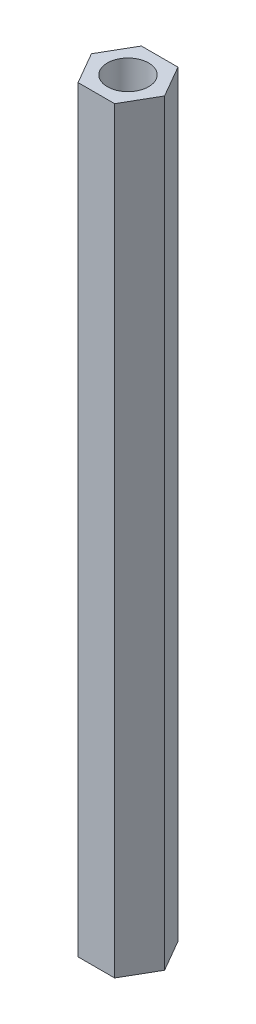
ISO-10303-21;
HEADER;
FILE_DESCRIPTION(('STEP AP214'),'2;1');
FILE_NAME('part.step','',(''),(''),'','','');
FILE_SCHEMA(('AUTOMOTIVE_DESIGN { 1 0 10303 214 1 1 1 1 }'));
ENDSEC;
DATA;
#1=APPLICATION_CONTEXT('core data for automotive mechanical design processes');
#2=APPLICATION_PROTOCOL_DEFINITION('international standard','automotive_design',2000,#1);
#3=PRODUCT_CONTEXT('',#1,'mechanical');
#4=PRODUCT('Part','Part','',(#3));
#5=PRODUCT_RELATED_PRODUCT_CATEGORY('part','',(#4));
#6=PRODUCT_DEFINITION_FORMATION('','',#4);
#7=PRODUCT_DEFINITION_CONTEXT('part definition',#1,'design');
#8=PRODUCT_DEFINITION('design','',#6,#7);
#9=PRODUCT_DEFINITION_SHAPE('','',#8);
#10=(LENGTH_UNIT() NAMED_UNIT(*) SI_UNIT(.MILLI.,.METRE.));
#11=(NAMED_UNIT(*) PLANE_ANGLE_UNIT() SI_UNIT($,.RADIAN.));
#12=(NAMED_UNIT(*) SI_UNIT($,.STERADIAN.) SOLID_ANGLE_UNIT());
#13=UNCERTAINTY_MEASURE_WITH_UNIT(LENGTH_MEASURE(1.E-05),#10,'distance_accuracy_value','');
#14=(GEOMETRIC_REPRESENTATION_CONTEXT(3) GLOBAL_UNCERTAINTY_ASSIGNED_CONTEXT((#13)) GLOBAL_UNIT_ASSIGNED_CONTEXT((#10,
#11,#12)) REPRESENTATION_CONTEXT('',''));
#15=CARTESIAN_POINT('',(0.,0.,0.));
#16=DIRECTION('',(0.,0.,1.));
#17=DIRECTION('',(1.,0.,0.));
#18=AXIS2_PLACEMENT_3D('',#15,#16,#17);
#19=CARTESIAN_POINT('',(-1.32790561913614,55.,2.3));
#20=DIRECTION('',(0.,0.,-1.));
#21=DIRECTION('',(-1.,0.,0.));
#22=AXIS2_PLACEMENT_3D('',#19,#20,#21);
#23=PLANE('',#22);
#24=DIRECTION('',(1.,0.,0.));
#25=VECTOR('',#24,1.);
#26=CARTESIAN_POINT('',(-1.32790561913614,0.,2.3));
#27=LINE('',#26,#25);
#28=CARTESIAN_POINT('',(-1.32790561913614,0.,2.3));
#29=VERTEX_POINT('',#28);
#30=CARTESIAN_POINT('',(1.32790561913614,0.,2.3));
#31=VERTEX_POINT('',#30);
#32=EDGE_CURVE('E128',#29,#31,#27,.T.);
#33=ORIENTED_EDGE('',*,*,#32,.T.);
#34=DIRECTION('',(0.,-1.,0.));
#35=VECTOR('',#34,1.);
#36=CARTESIAN_POINT('',(1.32790561913614,55.,2.3));
#37=LINE('',#36,#35);
#38=CARTESIAN_POINT('',(1.32790561913614,55.,2.3));
#39=VERTEX_POINT('',#38);
#40=EDGE_CURVE('E11',#39,#31,#37,.T.);
#41=ORIENTED_EDGE('',*,*,#40,.F.);
#42=DIRECTION('',(1.,0.,0.));
#43=VECTOR('',#42,1.);
#44=CARTESIAN_POINT('',(-1.32790561913614,55.,2.3));
#45=LINE('',#44,#43);
#46=CARTESIAN_POINT('',(-1.32790561913614,55.,2.3));
#47=VERTEX_POINT('',#46);
#48=EDGE_CURVE('E145',#47,#39,#45,.T.);
#49=ORIENTED_EDGE('',*,*,#48,.F.);
#50=DIRECTION('',(0.,-1.,0.));
#51=VECTOR('',#50,1.);
#52=CARTESIAN_POINT('',(-1.32790561913614,55.,2.3));
#53=LINE('',#52,#51);
#54=EDGE_CURVE('E124',#47,#29,#53,.T.);
#55=ORIENTED_EDGE('',*,*,#54,.T.);
#56=EDGE_LOOP('',(#33,#41,#49,#55));
#57=FACE_BOUND('',#56,.T.);
#58=ADVANCED_FACE('F39',(#57),#23,.F.);
#59=CARTESIAN_POINT('',(1.32790561913614,55.,2.3));
#60=DIRECTION('',(-0.866025403784439,0.,-0.5));
#61=DIRECTION('',(-0.5,0.,0.866025403784439));
#62=AXIS2_PLACEMENT_3D('',#59,#60,#61);
#63=PLANE('',#62);
#64=DIRECTION('',(0.5,0.,-0.866025403784438));
#65=VECTOR('',#64,1.);
#66=CARTESIAN_POINT('',(1.32790561913614,0.,2.3));
#67=LINE('',#66,#65);
#68=CARTESIAN_POINT('',(2.65581123827228,0.,0.));
#69=VERTEX_POINT('',#68);
#70=EDGE_CURVE('E132',#31,#69,#67,.T.);
#71=ORIENTED_EDGE('',*,*,#70,.T.);
#72=DIRECTION('',(0.,-1.,0.));
#73=VECTOR('',#72,1.);
#74=CARTESIAN_POINT('',(2.65581123827228,55.,0.));
#75=LINE('',#74,#73);
#76=CARTESIAN_POINT('',(2.65581123827228,55.,0.));
#77=VERTEX_POINT('',#76);
#78=EDGE_CURVE('E48',#77,#69,#75,.T.);
#79=ORIENTED_EDGE('',*,*,#78,.F.);
#80=DIRECTION('',(0.5,0.,-0.866025403784438));
#81=VECTOR('',#80,1.);
#82=CARTESIAN_POINT('',(1.32790561913614,55.,2.3));
#83=LINE('',#82,#81);
#84=EDGE_CURVE('E93',#39,#77,#83,.T.);
#85=ORIENTED_EDGE('',*,*,#84,.F.);
#86=ORIENTED_EDGE('',*,*,#40,.T.);
#87=EDGE_LOOP('',(#71,#79,#85,#86));
#88=FACE_BOUND('',#87,.T.);
#89=ADVANCED_FACE('F174',(#88),#63,.F.);
#90=CARTESIAN_POINT('',(2.65581123827228,55.,0.));
#91=DIRECTION('',(-0.866025403784439,0.,0.5));
#92=DIRECTION('',(0.5,0.,0.866025403784439));
#93=AXIS2_PLACEMENT_3D('',#90,#91,#92);
#94=PLANE('',#93);
#95=DIRECTION('',(-0.5,0.,-0.866025403784439));
#96=VECTOR('',#95,1.);
#97=CARTESIAN_POINT('',(2.65581123827228,0.,0.));
#98=LINE('',#97,#96);
#99=CARTESIAN_POINT('',(1.32790561913614,0.,-2.3));
#100=VERTEX_POINT('',#99);
#101=EDGE_CURVE('E136',#69,#100,#98,.T.);
#102=ORIENTED_EDGE('',*,*,#101,.T.);
#103=DIRECTION('',(0.,-1.,0.));
#104=VECTOR('',#103,1.);
#105=CARTESIAN_POINT('',(1.32790561913614,55.,-2.3));
#106=LINE('',#105,#104);
#107=CARTESIAN_POINT('',(1.32790561913614,55.,-2.3));
#108=VERTEX_POINT('',#107);
#109=EDGE_CURVE('E117',#108,#100,#106,.T.);
#110=ORIENTED_EDGE('',*,*,#109,.F.);
#111=DIRECTION('',(-0.5,0.,-0.866025403784439));
#112=VECTOR('',#111,1.);
#113=CARTESIAN_POINT('',(2.65581123827228,55.,0.));
#114=LINE('',#113,#112);
#115=EDGE_CURVE('E106',#77,#108,#114,.T.);
#116=ORIENTED_EDGE('',*,*,#115,.F.);
#117=ORIENTED_EDGE('',*,*,#78,.T.);
#118=EDGE_LOOP('',(#102,#110,#116,#117));
#119=FACE_BOUND('',#118,.T.);
#120=ADVANCED_FACE('F155',(#119),#94,.F.);
#121=CARTESIAN_POINT('',(1.32790561913614,55.,-2.3));
#122=DIRECTION('',(0.,0.,1.));
#123=DIRECTION('',(1.,0.,0.));
#124=AXIS2_PLACEMENT_3D('',#121,#122,#123);
#125=PLANE('',#124);
#126=DIRECTION('',(-1.,0.,0.));
#127=VECTOR('',#126,1.);
#128=CARTESIAN_POINT('',(1.32790561913614,0.,-2.3));
#129=LINE('',#128,#127);
#130=CARTESIAN_POINT('',(-1.32790561913614,0.,-2.3));
#131=VERTEX_POINT('',#130);
#132=EDGE_CURVE('E115',#100,#131,#129,.T.);
#133=ORIENTED_EDGE('',*,*,#132,.T.);
#134=DIRECTION('',(0.,-1.,0.));
#135=VECTOR('',#134,1.);
#136=CARTESIAN_POINT('',(-1.32790561913614,55.,-2.3));
#137=LINE('',#136,#135);
#138=CARTESIAN_POINT('',(-1.32790561913614,55.,-2.3));
#139=VERTEX_POINT('',#138);
#140=EDGE_CURVE('E112',#139,#131,#137,.T.);
#141=ORIENTED_EDGE('',*,*,#140,.F.);
#142=DIRECTION('',(-1.,0.,0.));
#143=VECTOR('',#142,1.);
#144=CARTESIAN_POINT('',(1.32790561913614,55.,-2.3));
#145=LINE('',#144,#143);
#146=EDGE_CURVE('E100',#108,#139,#145,.T.);
#147=ORIENTED_EDGE('',*,*,#146,.F.);
#148=ORIENTED_EDGE('',*,*,#109,.T.);
#149=EDGE_LOOP('',(#133,#141,#147,#148));
#150=FACE_BOUND('',#149,.T.);
#151=ADVANCED_FACE('F113',(#150),#125,.F.);
#152=CARTESIAN_POINT('',(-1.32790561913614,55.,-2.3));
#153=DIRECTION('',(0.866025403784439,0.,0.5));
#154=DIRECTION('',(0.5,0.,-0.866025403784439));
#155=AXIS2_PLACEMENT_3D('',#152,#153,#154);
#156=PLANE('',#155);
#157=DIRECTION('',(-0.5,0.,0.866025403784438));
#158=VECTOR('',#157,1.);
#159=CARTESIAN_POINT('',(-1.32790561913614,0.,-2.3));
#160=LINE('',#159,#158);
#161=CARTESIAN_POINT('',(-2.65581123827228,0.,0.));
#162=VERTEX_POINT('',#161);
#163=EDGE_CURVE('E79',#131,#162,#160,.T.);
#164=ORIENTED_EDGE('',*,*,#163,.T.);
#165=DIRECTION('',(0.,-1.,0.));
#166=VECTOR('',#165,1.);
#167=CARTESIAN_POINT('',(-2.65581123827228,55.,0.));
#168=LINE('',#167,#166);
#169=CARTESIAN_POINT('',(-2.65581123827228,55.,0.));
#170=VERTEX_POINT('',#169);
#171=EDGE_CURVE('E118',#170,#162,#168,.T.);
#172=ORIENTED_EDGE('',*,*,#171,.F.);
#173=DIRECTION('',(-0.5,0.,0.866025403784438));
#174=VECTOR('',#173,1.);
#175=CARTESIAN_POINT('',(-1.32790561913614,55.,-2.3));
#176=LINE('',#175,#174);
#177=EDGE_CURVE('E104',#139,#170,#176,.T.);
#178=ORIENTED_EDGE('',*,*,#177,.F.);
#179=ORIENTED_EDGE('',*,*,#140,.T.);
#180=EDGE_LOOP('',(#164,#172,#178,#179));
#181=FACE_BOUND('',#180,.T.);
#182=ADVANCED_FACE('F120',(#181),#156,.F.);
#183=CARTESIAN_POINT('',(-2.65581123827228,55.,0.));
#184=DIRECTION('',(0.866025403784439,0.,-0.5));
#185=DIRECTION('',(-0.5,0.,-0.866025403784439));
#186=AXIS2_PLACEMENT_3D('',#183,#184,#185);
#187=PLANE('',#186);
#188=DIRECTION('',(0.5,0.,0.866025403784439));
#189=VECTOR('',#188,1.);
#190=CARTESIAN_POINT('',(-2.65581123827228,0.,0.));
#191=LINE('',#190,#189);
#192=EDGE_CURVE('E85',#162,#29,#191,.T.);
#193=ORIENTED_EDGE('',*,*,#192,.T.);
#194=ORIENTED_EDGE('',*,*,#54,.F.);
#195=DIRECTION('',(0.5,0.,0.866025403784439));
#196=VECTOR('',#195,1.);
#197=CARTESIAN_POINT('',(-2.65581123827228,55.,0.));
#198=LINE('',#197,#196);
#199=EDGE_CURVE('E56',#170,#47,#198,.T.);
#200=ORIENTED_EDGE('',*,*,#199,.F.);
#201=ORIENTED_EDGE('',*,*,#171,.T.);
#202=EDGE_LOOP('',(#193,#194,#200,#201));
#203=FACE_BOUND('',#202,.T.);
#204=ADVANCED_FACE('F162',(#203),#187,.F.);
#205=CARTESIAN_POINT('',(0.,55.,0.));
#206=DIRECTION('',(0.,1.,0.));
#207=DIRECTION('',(0.,0.,1.));
#208=AXIS2_PLACEMENT_3D('',#205,#206,#207);
#209=PLANE('',#208);
#210=CARTESIAN_POINT('',(0.,55.,0.));
#211=DIRECTION('',(0.,1.,0.));
#212=DIRECTION('',(0.,0.,1.));
#213=AXIS2_PLACEMENT_3D('',#210,#211,#212);
#214=CIRCLE('',#213,1.5);
#215=CARTESIAN_POINT('',(0.,55.,1.5));
#216=VERTEX_POINT('',#215);
#217=EDGE_CURVE('E229',#216,#216,#214,.T.);
#218=ORIENTED_EDGE('',*,*,#217,.F.);
#219=EDGE_LOOP('',(#218));
#220=FACE_BOUND('',#219,.T.);
#221=ORIENTED_EDGE('',*,*,#48,.T.);
#222=ORIENTED_EDGE('',*,*,#84,.T.);
#223=ORIENTED_EDGE('',*,*,#115,.T.);
#224=ORIENTED_EDGE('',*,*,#146,.T.);
#225=ORIENTED_EDGE('',*,*,#177,.T.);
#226=ORIENTED_EDGE('',*,*,#199,.T.);
#227=EDGE_LOOP('',(#221,#222,#223,#224,#225,#226));
#228=FACE_BOUND('',#227,.T.);
#229=ADVANCED_FACE('F102',(#220,#228),#209,.T.);
#230=CARTESIAN_POINT('',(0.,0.,0.));
#231=DIRECTION('',(0.,1.,0.));
#232=DIRECTION('',(0.,0.,1.));
#233=AXIS2_PLACEMENT_3D('',#230,#231,#232);
#234=PLANE('',#233);
#235=CARTESIAN_POINT('',(0.,0.,0.));
#236=DIRECTION('',(0.,1.,0.));
#237=DIRECTION('',(0.,0.,1.));
#238=AXIS2_PLACEMENT_3D('',#235,#236,#237);
#239=CIRCLE('',#238,1.5);
#240=CARTESIAN_POINT('',(0.,0.,1.5));
#241=VERTEX_POINT('',#240);
#242=EDGE_CURVE('E133',#241,#241,#239,.T.);
#243=ORIENTED_EDGE('',*,*,#242,.T.);
#244=EDGE_LOOP('',(#243));
#245=FACE_BOUND('',#244,.T.);
#246=ORIENTED_EDGE('',*,*,#32,.F.);
#247=ORIENTED_EDGE('',*,*,#192,.F.);
#248=ORIENTED_EDGE('',*,*,#163,.F.);
#249=ORIENTED_EDGE('',*,*,#132,.F.);
#250=ORIENTED_EDGE('',*,*,#101,.F.);
#251=ORIENTED_EDGE('',*,*,#70,.F.);
#252=EDGE_LOOP('',(#246,#247,#248,#249,#250,#251));
#253=FACE_BOUND('',#252,.T.);
#254=ADVANCED_FACE('F158',(#245,#253),#234,.F.);
#255=CARTESIAN_POINT('',(0.,0.,0.));
#256=DIRECTION('',(0.,1.,0.));
#257=DIRECTION('',(0.,0.,1.));
#258=AXIS2_PLACEMENT_3D('',#255,#256,#257);
#259=CYLINDRICAL_SURFACE('',#258,1.5);
#260=ORIENTED_EDGE('',*,*,#242,.F.);
#261=EDGE_LOOP('',(#260));
#262=FACE_BOUND('',#261,.T.);
#263=ORIENTED_EDGE('',*,*,#217,.T.);
#264=EDGE_LOOP('',(#263));
#265=FACE_BOUND('',#264,.T.);
#266=ADVANCED_FACE('F211',(#262,#265),#259,.F.);
#267=CLOSED_SHELL('',(#58,#89,#120,#151,#182,#204,#229,#254,#266));
#268=MANIFOLD_SOLID_BREP('B2',#267);
#269=ADVANCED_BREP_SHAPE_REPRESENTATION('',(#18,#268),#14);
#270=SHAPE_DEFINITION_REPRESENTATION(#9,#269);
ENDSEC;
END-ISO-10303-21;
